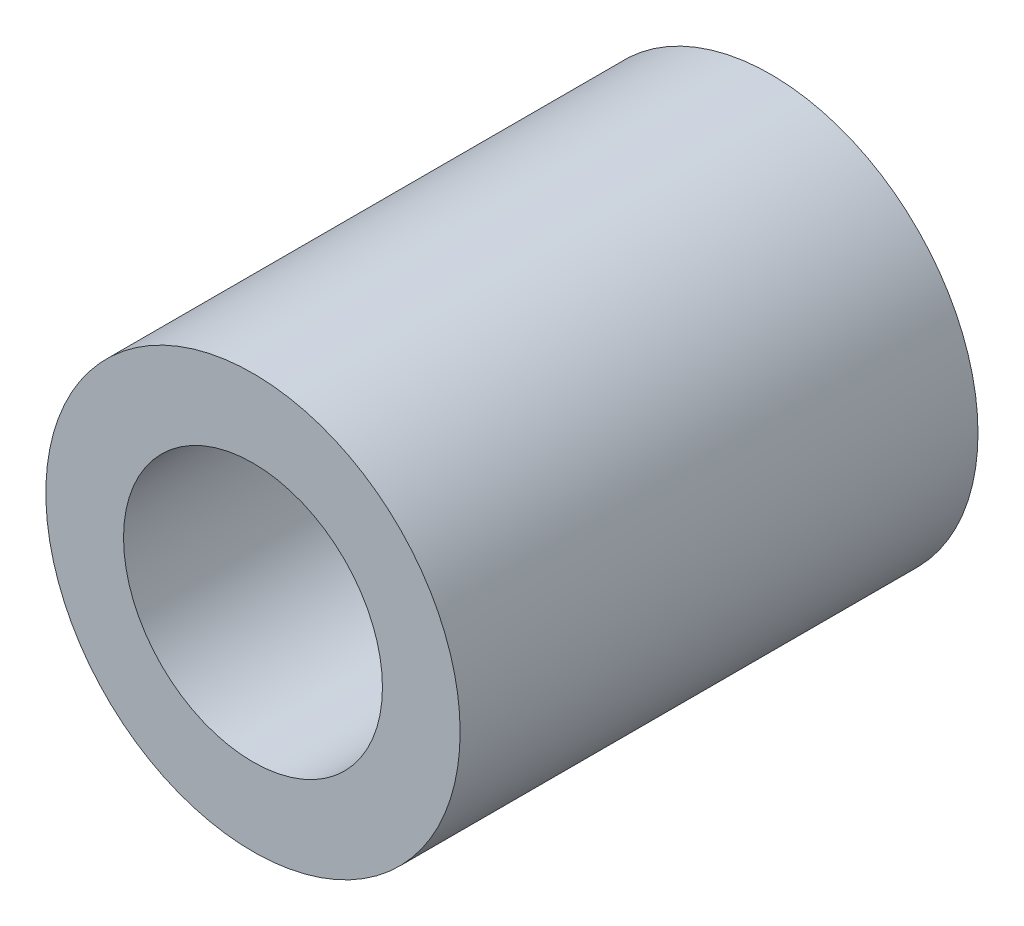
ISO-10303-21;
HEADER;
FILE_DESCRIPTION(('STEP AP214'),'2;1');
FILE_NAME('part.step','',(''),(''),'','','');
FILE_SCHEMA(('AUTOMOTIVE_DESIGN { 1 0 10303 214 1 1 1 1 }'));
ENDSEC;
DATA;
#1=APPLICATION_CONTEXT('core data for automotive mechanical design processes');
#2=APPLICATION_PROTOCOL_DEFINITION('international standard','automotive_design',2000,#1);
#3=PRODUCT_CONTEXT('',#1,'mechanical');
#4=PRODUCT('Part','Part','',(#3));
#5=PRODUCT_RELATED_PRODUCT_CATEGORY('part','',(#4));
#6=PRODUCT_DEFINITION_FORMATION('','',#4);
#7=PRODUCT_DEFINITION_CONTEXT('part definition',#1,'design');
#8=PRODUCT_DEFINITION('design','',#6,#7);
#9=PRODUCT_DEFINITION_SHAPE('','',#8);
#10=(LENGTH_UNIT() NAMED_UNIT(*) SI_UNIT(.MILLI.,.METRE.));
#11=(NAMED_UNIT(*) PLANE_ANGLE_UNIT() SI_UNIT($,.RADIAN.));
#12=(NAMED_UNIT(*) SI_UNIT($,.STERADIAN.) SOLID_ANGLE_UNIT());
#13=UNCERTAINTY_MEASURE_WITH_UNIT(LENGTH_MEASURE(1.E-05),#10,'distance_accuracy_value','');
#14=(GEOMETRIC_REPRESENTATION_CONTEXT(3) GLOBAL_UNCERTAINTY_ASSIGNED_CONTEXT((#13)) GLOBAL_UNIT_ASSIGNED_CONTEXT((#10,
#11,#12)) REPRESENTATION_CONTEXT('',''));
#15=CARTESIAN_POINT('',(0.,0.,0.));
#16=DIRECTION('',(0.,0.,1.));
#17=DIRECTION('',(1.,0.,0.));
#18=AXIS2_PLACEMENT_3D('',#15,#16,#17);
#19=CARTESIAN_POINT('',(0.,0.,10.));
#20=DIRECTION('',(0.,0.,1.));
#21=DIRECTION('',(1.,0.,0.));
#22=AXIS2_PLACEMENT_3D('',#19,#20,#21);
#23=PLANE('',#22);
#24=CARTESIAN_POINT('',(0.,0.,10.));
#25=DIRECTION('',(0.,0.,1.));
#26=DIRECTION('',(1.,0.,0.));
#27=AXIS2_PLACEMENT_3D('',#24,#25,#26);
#28=CIRCLE('',#27,4.);
#29=CARTESIAN_POINT('',(4.,0.,10.));
#30=VERTEX_POINT('',#29);
#31=EDGE_CURVE('E10',#30,#30,#28,.T.);
#32=ORIENTED_EDGE('',*,*,#31,.T.);
#33=EDGE_LOOP('',(#32));
#34=FACE_BOUND('',#33,.T.);
#35=CARTESIAN_POINT('',(0.,0.,10.));
#36=DIRECTION('',(0.,0.,1.));
#37=DIRECTION('',(1.,0.,0.));
#38=AXIS2_PLACEMENT_3D('',#35,#36,#37);
#39=CIRCLE('',#38,2.5);
#40=CARTESIAN_POINT('',(2.5,0.,10.));
#41=VERTEX_POINT('',#40);
#42=EDGE_CURVE('E41',#41,#41,#39,.T.);
#43=ORIENTED_EDGE('',*,*,#42,.F.);
#44=EDGE_LOOP('',(#43));
#45=FACE_BOUND('',#44,.T.);
#46=ADVANCED_FACE('F30',(#34,#45),#23,.T.);
#47=CARTESIAN_POINT('',(0.,0.,0.));
#48=DIRECTION('',(0.,0.,1.));
#49=DIRECTION('',(1.,0.,0.));
#50=AXIS2_PLACEMENT_3D('',#47,#48,#49);
#51=PLANE('',#50);
#52=CARTESIAN_POINT('',(0.,0.,0.));
#53=DIRECTION('',(0.,0.,1.));
#54=DIRECTION('',(1.,0.,0.));
#55=AXIS2_PLACEMENT_3D('',#52,#53,#54);
#56=CIRCLE('',#55,4.);
#57=CARTESIAN_POINT('',(4.,0.,0.));
#58=VERTEX_POINT('',#57);
#59=EDGE_CURVE('E34',#58,#58,#56,.T.);
#60=ORIENTED_EDGE('',*,*,#59,.F.);
#61=EDGE_LOOP('',(#60));
#62=FACE_BOUND('',#61,.T.);
#63=CARTESIAN_POINT('',(0.,0.,0.));
#64=DIRECTION('',(0.,0.,1.));
#65=DIRECTION('',(1.,0.,0.));
#66=AXIS2_PLACEMENT_3D('',#63,#64,#65);
#67=CIRCLE('',#66,2.5);
#68=CARTESIAN_POINT('',(2.5,0.,0.));
#69=VERTEX_POINT('',#68);
#70=EDGE_CURVE('E43',#69,#69,#67,.T.);
#71=ORIENTED_EDGE('',*,*,#70,.T.);
#72=EDGE_LOOP('',(#71));
#73=FACE_BOUND('',#72,.T.);
#74=ADVANCED_FACE('F53',(#62,#73),#51,.F.);
#75=CARTESIAN_POINT('',(0.,0.,10.));
#76=DIRECTION('',(0.,0.,-1.));
#77=DIRECTION('',(-1.,0.,0.));
#78=AXIS2_PLACEMENT_3D('',#75,#76,#77);
#79=CYLINDRICAL_SURFACE('',#78,4.);
#80=ORIENTED_EDGE('',*,*,#31,.F.);
#81=EDGE_LOOP('',(#80));
#82=FACE_BOUND('',#81,.T.);
#83=ORIENTED_EDGE('',*,*,#59,.T.);
#84=EDGE_LOOP('',(#83));
#85=FACE_BOUND('',#84,.T.);
#86=ADVANCED_FACE('F32',(#82,#85),#79,.T.);
#87=CARTESIAN_POINT('',(0.,0.,10.));
#88=DIRECTION('',(0.,0.,-1.));
#89=DIRECTION('',(-1.,0.,0.));
#90=AXIS2_PLACEMENT_3D('',#87,#88,#89);
#91=CYLINDRICAL_SURFACE('',#90,2.5);
#92=ORIENTED_EDGE('',*,*,#42,.T.);
#93=EDGE_LOOP('',(#92));
#94=FACE_BOUND('',#93,.T.);
#95=ORIENTED_EDGE('',*,*,#70,.F.);
#96=EDGE_LOOP('',(#95));
#97=FACE_BOUND('',#96,.T.);
#98=ADVANCED_FACE('F49',(#94,#97),#91,.F.);
#99=CLOSED_SHELL('',(#46,#74,#86,#98));
#100=MANIFOLD_SOLID_BREP('B2',#99);
#101=ADVANCED_BREP_SHAPE_REPRESENTATION('',(#18,#100),#14);
#102=SHAPE_DEFINITION_REPRESENTATION(#9,#101);
ENDSEC;
END-ISO-10303-21;
